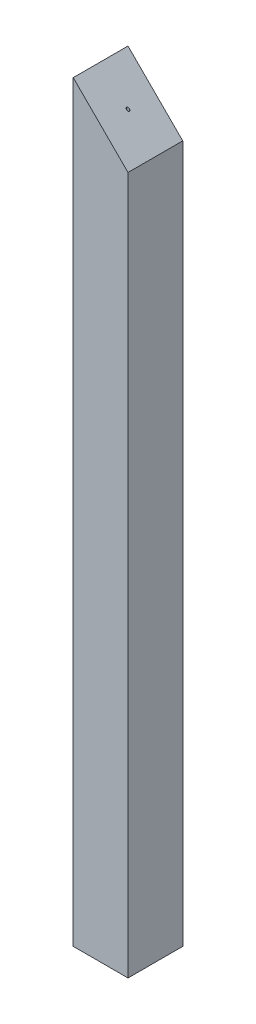
ISO-10303-21;
HEADER;
FILE_DESCRIPTION(('STEP AP214'),'2;1');
FILE_NAME('part.step','',(''),(''),'','','');
FILE_SCHEMA(('AUTOMOTIVE_DESIGN { 1 0 10303 214 1 1 1 1 }'));
ENDSEC;
DATA;
#1=APPLICATION_CONTEXT('core data for automotive mechanical design processes');
#2=APPLICATION_PROTOCOL_DEFINITION('international standard','automotive_design',2000,#1);
#3=PRODUCT_CONTEXT('',#1,'mechanical');
#4=PRODUCT('Part','Part','',(#3));
#5=PRODUCT_RELATED_PRODUCT_CATEGORY('part','',(#4));
#6=PRODUCT_DEFINITION_FORMATION('','',#4);
#7=PRODUCT_DEFINITION_CONTEXT('part definition',#1,'design');
#8=PRODUCT_DEFINITION('design','',#6,#7);
#9=PRODUCT_DEFINITION_SHAPE('','',#8);
#10=(LENGTH_UNIT() NAMED_UNIT(*) SI_UNIT(.MILLI.,.METRE.));
#11=(NAMED_UNIT(*) PLANE_ANGLE_UNIT() SI_UNIT($,.RADIAN.));
#12=(NAMED_UNIT(*) SI_UNIT($,.STERADIAN.) SOLID_ANGLE_UNIT());
#13=UNCERTAINTY_MEASURE_WITH_UNIT(LENGTH_MEASURE(1.E-05),#10,'distance_accuracy_value','');
#14=(GEOMETRIC_REPRESENTATION_CONTEXT(3) GLOBAL_UNCERTAINTY_ASSIGNED_CONTEXT((#13)) GLOBAL_UNIT_ASSIGNED_CONTEXT((#10,
#11,#12)) REPRESENTATION_CONTEXT('',''));
#15=CARTESIAN_POINT('',(0.,0.,0.));
#16=DIRECTION('',(0.,0.,1.));
#17=DIRECTION('',(1.,0.,0.));
#18=AXIS2_PLACEMENT_3D('',#15,#16,#17);
#19=CARTESIAN_POINT('',(12.7,174.485,-12.7));
#20=DIRECTION('',(-1.,0.,0.));
#21=DIRECTION('',(0.,0.,1.));
#22=AXIS2_PLACEMENT_3D('',#19,#20,#21);
#23=PLANE('',#22);
#24=DIRECTION('',(0.,-1.,0.));
#25=VECTOR('',#24,1.);
#26=CARTESIAN_POINT('',(12.7,174.485,-12.7));
#27=LINE('',#26,#25);
#28=CARTESIAN_POINT('',(12.7,149.085,-12.7));
#29=VERTEX_POINT('',#28);
#30=CARTESIAN_POINT('',(12.7,-174.485,-12.7));
#31=VERTEX_POINT('',#30);
#32=EDGE_CURVE('E11',#29,#31,#27,.T.);
#33=ORIENTED_EDGE('',*,*,#32,.F.);
#34=DIRECTION('',(0.,0.,1.));
#35=VECTOR('',#34,1.);
#36=CARTESIAN_POINT('',(12.7,149.085,-12.7));
#37=LINE('',#36,#35);
#38=CARTESIAN_POINT('',(12.7,149.085,12.7));
#39=VERTEX_POINT('',#38);
#40=EDGE_CURVE('E105',#29,#39,#37,.T.);
#41=ORIENTED_EDGE('',*,*,#40,.T.);
#42=DIRECTION('',(0.,-1.,0.));
#43=VECTOR('',#42,1.);
#44=CARTESIAN_POINT('',(12.7,174.485,12.7));
#45=LINE('',#44,#43);
#46=CARTESIAN_POINT('',(12.7,-174.485,12.7));
#47=VERTEX_POINT('',#46);
#48=EDGE_CURVE('E90',#39,#47,#45,.T.);
#49=ORIENTED_EDGE('',*,*,#48,.T.);
#50=DIRECTION('',(0.,0.,-1.));
#51=VECTOR('',#50,1.);
#52=CARTESIAN_POINT('',(12.7,-174.485,-12.7));
#53=LINE('',#52,#51);
#54=EDGE_CURVE('E94',#47,#31,#53,.T.);
#55=ORIENTED_EDGE('',*,*,#54,.T.);
#56=EDGE_LOOP('',(#33,#41,#49,#55));
#57=FACE_BOUND('',#56,.T.);
#58=ADVANCED_FACE('F37',(#57),#23,.F.);
#59=CARTESIAN_POINT('',(-12.7,174.485,-12.7));
#60=DIRECTION('',(0.,0.,1.));
#61=DIRECTION('',(1.,0.,0.));
#62=AXIS2_PLACEMENT_3D('',#59,#60,#61);
#63=PLANE('',#62);
#64=DIRECTION('',(0.,-1.,0.));
#65=VECTOR('',#64,1.);
#66=CARTESIAN_POINT('',(-12.7,174.485,-12.7));
#67=LINE('',#66,#65);
#68=CARTESIAN_POINT('',(-12.7,174.485,-12.7));
#69=VERTEX_POINT('',#68);
#70=CARTESIAN_POINT('',(-12.7,-174.485,-12.7));
#71=VERTEX_POINT('',#70);
#72=EDGE_CURVE('E46',#69,#71,#67,.T.);
#73=ORIENTED_EDGE('',*,*,#72,.F.);
#74=DIRECTION('',(0.707106781186549,-0.707106781186546,0.));
#75=VECTOR('',#74,1.);
#76=CARTESIAN_POINT('',(-12.7,174.485,-12.7));
#77=LINE('',#76,#75);
#78=EDGE_CURVE('E53',#69,#29,#77,.T.);
#79=ORIENTED_EDGE('',*,*,#78,.T.);
#80=ORIENTED_EDGE('',*,*,#32,.T.);
#81=DIRECTION('',(-1.,0.,0.));
#82=VECTOR('',#81,1.);
#83=CARTESIAN_POINT('',(-12.7,-174.485,-12.7));
#84=LINE('',#83,#82);
#85=EDGE_CURVE('E80',#31,#71,#84,.T.);
#86=ORIENTED_EDGE('',*,*,#85,.T.);
#87=EDGE_LOOP('',(#73,#79,#80,#86));
#88=FACE_BOUND('',#87,.T.);
#89=ADVANCED_FACE('F132',(#88),#63,.F.);
#90=CARTESIAN_POINT('',(-12.7,174.485,-12.7));
#91=DIRECTION('',(1.,0.,0.));
#92=DIRECTION('',(0.,0.,-1.));
#93=AXIS2_PLACEMENT_3D('',#90,#91,#92);
#94=PLANE('',#93);
#95=DIRECTION('',(0.,0.,1.));
#96=VECTOR('',#95,1.);
#97=CARTESIAN_POINT('',(-12.7,-174.485,-12.7));
#98=LINE('',#97,#96);
#99=CARTESIAN_POINT('',(-12.7,-174.485,12.7));
#100=VERTEX_POINT('',#99);
#101=EDGE_CURVE('E70',#71,#100,#98,.T.);
#102=ORIENTED_EDGE('',*,*,#101,.T.);
#103=DIRECTION('',(0.,-1.,0.));
#104=VECTOR('',#103,1.);
#105=CARTESIAN_POINT('',(-12.7,174.485,12.7));
#106=LINE('',#105,#104);
#107=CARTESIAN_POINT('',(-12.7,174.485,12.7));
#108=VERTEX_POINT('',#107);
#109=EDGE_CURVE('E75',#108,#100,#106,.T.);
#110=ORIENTED_EDGE('',*,*,#109,.F.);
#111=DIRECTION('',(0.,0.,1.));
#112=VECTOR('',#111,1.);
#113=CARTESIAN_POINT('',(-12.7,174.485,-12.7));
#114=LINE('',#113,#112);
#115=EDGE_CURVE('E95',#69,#108,#114,.T.);
#116=ORIENTED_EDGE('',*,*,#115,.F.);
#117=ORIENTED_EDGE('',*,*,#72,.T.);
#118=EDGE_LOOP('',(#102,#110,#116,#117));
#119=FACE_BOUND('',#118,.T.);
#120=ADVANCED_FACE('F72',(#119),#94,.F.);
#121=CARTESIAN_POINT('',(-12.7,174.485,12.7));
#122=DIRECTION('',(0.,0.,-1.));
#123=DIRECTION('',(-1.,0.,0.));
#124=AXIS2_PLACEMENT_3D('',#121,#122,#123);
#125=PLANE('',#124);
#126=ORIENTED_EDGE('',*,*,#48,.F.);
#127=DIRECTION('',(0.707106781186549,-0.707106781186546,0.));
#128=VECTOR('',#127,1.);
#129=CARTESIAN_POINT('',(-12.7,174.485,12.7));
#130=LINE('',#129,#128);
#131=EDGE_CURVE('E89',#108,#39,#130,.T.);
#132=ORIENTED_EDGE('',*,*,#131,.F.);
#133=ORIENTED_EDGE('',*,*,#109,.T.);
#134=DIRECTION('',(1.,0.,0.));
#135=VECTOR('',#134,1.);
#136=CARTESIAN_POINT('',(-12.7,-174.485,12.7));
#137=LINE('',#136,#135);
#138=EDGE_CURVE('E79',#100,#47,#137,.T.);
#139=ORIENTED_EDGE('',*,*,#138,.T.);
#140=EDGE_LOOP('',(#126,#132,#133,#139));
#141=FACE_BOUND('',#140,.T.);
#142=ADVANCED_FACE('F86',(#141),#125,.F.);
#143=CARTESIAN_POINT('',(0.,-174.485,0.));
#144=DIRECTION('',(0.,1.,0.));
#145=DIRECTION('',(0.,0.,1.));
#146=AXIS2_PLACEMENT_3D('',#143,#144,#145);
#147=PLANE('',#146);
#148=CARTESIAN_POINT('',(0.,-174.485,0.));
#149=DIRECTION('',(0.,-1.,0.));
#150=DIRECTION('',(0.,0.,-1.));
#151=AXIS2_PLACEMENT_3D('',#148,#149,#150);
#152=CIRCLE('',#151,1.5113);
#153=CARTESIAN_POINT('',(0.,-174.485,-1.5113));
#154=VERTEX_POINT('',#153);
#155=EDGE_CURVE('E128',#154,#154,#152,.T.);
#156=ORIENTED_EDGE('',*,*,#155,.F.);
#157=EDGE_LOOP('',(#156));
#158=FACE_BOUND('',#157,.T.);
#159=ORIENTED_EDGE('',*,*,#54,.F.);
#160=ORIENTED_EDGE('',*,*,#138,.F.);
#161=ORIENTED_EDGE('',*,*,#101,.F.);
#162=ORIENTED_EDGE('',*,*,#85,.F.);
#163=EDGE_LOOP('',(#159,#160,#161,#162));
#164=FACE_BOUND('',#163,.T.);
#165=ADVANCED_FACE('F92',(#158,#164),#147,.F.);
#166=CARTESIAN_POINT('',(0.,-154.485,0.));
#167=DIRECTION('',(0.,-1.,0.));
#168=DIRECTION('',(0.,0.,-1.));
#169=AXIS2_PLACEMENT_3D('',#166,#167,#168);
#170=CONICAL_SURFACE('',#169,0.595629999999985,1.02974425867667);
#171=CARTESIAN_POINT('',(0.,-154.127109389489,0.));
#172=VERTEX_POINT('',#171);
#173=VERTEX_LOOP('',#172);
#174=FACE_BOUND('',#173,.T.);
#175=CARTESIAN_POINT('',(0.,-154.485,0.));
#176=DIRECTION('',(0.,-1.,0.));
#177=DIRECTION('',(0.,0.,-1.));
#178=AXIS2_PLACEMENT_3D('',#175,#176,#177);
#179=CIRCLE('',#178,0.595629999999985);
#180=CARTESIAN_POINT('',(0.,-154.485,-0.595629999999985));
#181=VERTEX_POINT('',#180);
#182=EDGE_CURVE('E122',#181,#181,#179,.T.);
#183=ORIENTED_EDGE('',*,*,#182,.T.);
#184=EDGE_LOOP('',(#183));
#185=FACE_BOUND('',#184,.T.);
#186=ADVANCED_FACE('F115',(#174,#185),#170,.F.);
#187=CARTESIAN_POINT('',(0.,-174.485,0.));
#188=DIRECTION('',(0.,-1.,0.));
#189=DIRECTION('',(0.,0.,-1.));
#190=AXIS2_PLACEMENT_3D('',#187,#188,#189);
#191=CYLINDRICAL_SURFACE('',#190,0.595629999999987);
#192=ORIENTED_EDGE('',*,*,#182,.F.);
#193=EDGE_LOOP('',(#192));
#194=FACE_BOUND('',#193,.T.);
#195=CARTESIAN_POINT('',(0.,-173.71666164072,0.));
#196=DIRECTION('',(0.,-1.,0.));
#197=DIRECTION('',(0.,0.,-1.));
#198=AXIS2_PLACEMENT_3D('',#195,#196,#197);
#199=CIRCLE('',#198,0.595629999999989);
#200=CARTESIAN_POINT('',(0.,-173.71666164072,-0.595629999999989));
#201=VERTEX_POINT('',#200);
#202=EDGE_CURVE('E124',#201,#201,#199,.T.);
#203=ORIENTED_EDGE('',*,*,#202,.T.);
#204=EDGE_LOOP('',(#203));
#205=FACE_BOUND('',#204,.T.);
#206=ADVANCED_FACE('F118',(#194,#205),#191,.F.);
#207=CARTESIAN_POINT('',(0.,-174.485,0.));
#208=DIRECTION('',(0.,-1.,0.));
#209=DIRECTION('',(0.,0.,-1.));
#210=AXIS2_PLACEMENT_3D('',#207,#208,#209);
#211=CONICAL_SURFACE('',#210,1.5113,0.872664625997162);
#212=ORIENTED_EDGE('',*,*,#202,.F.);
#213=EDGE_LOOP('',(#212));
#214=FACE_BOUND('',#213,.T.);
#215=ORIENTED_EDGE('',*,*,#155,.T.);
#216=EDGE_LOOP('',(#215));
#217=FACE_BOUND('',#216,.T.);
#218=ADVANCED_FACE('F142',(#214,#217),#211,.F.);
#219=CARTESIAN_POINT('',(-12.7,174.485,-12.7));
#220=DIRECTION('',(-0.707106781186546,-0.707106781186548,0.));
#221=DIRECTION('',(0.707106781186549,-0.707106781186547,0.));
#222=AXIS2_PLACEMENT_3D('',#219,#220,#221);
#223=PLANE('',#222);
#224=ORIENTED_EDGE('',*,*,#40,.F.);
#225=ORIENTED_EDGE('',*,*,#78,.F.);
#226=ORIENTED_EDGE('',*,*,#115,.T.);
#227=ORIENTED_EDGE('',*,*,#131,.T.);
#228=EDGE_LOOP('',(#224,#225,#226,#227));
#229=FACE_BOUND('',#228,.T.);
#230=CARTESIAN_POINT('',(0.,161.785,0.));
#231=DIRECTION('',(-0.707106781186546,-0.707106781186548,0.));
#232=DIRECTION('',(-0.707106781186549,0.707106781186547,0.));
#233=AXIS2_PLACEMENT_3D('',#230,#231,#232);
#234=ELLIPSE('',#233,0.842348024156268,0.595629999999987);
#235=CARTESIAN_POINT('',(-0.595629999999987,162.38063,0.));
#236=VERTEX_POINT('',#235);
#237=EDGE_CURVE('E40',#236,#236,#234,.F.);
#238=ORIENTED_EDGE('',*,*,#237,.F.);
#239=EDGE_LOOP('',(#238));
#240=FACE_BOUND('',#239,.T.);
#241=ADVANCED_FACE('F170',(#229,#240),#223,.F.);
#242=CARTESIAN_POINT('',(0.,154.485,0.));
#243=DIRECTION('',(0.,1.,0.));
#244=DIRECTION('',(0.,0.,1.));
#245=AXIS2_PLACEMENT_3D('',#242,#243,#244);
#246=CONICAL_SURFACE('',#245,0.595629999999985,1.02974425867667);
#247=CARTESIAN_POINT('',(0.,154.127109389489,0.));
#248=VERTEX_POINT('',#247);
#249=VERTEX_LOOP('',#248);
#250=FACE_BOUND('',#249,.T.);
#251=CARTESIAN_POINT('',(0.,154.485,0.));
#252=DIRECTION('',(0.,1.,0.));
#253=DIRECTION('',(0.,0.,1.));
#254=AXIS2_PLACEMENT_3D('',#251,#252,#253);
#255=CIRCLE('',#254,0.595629999999985);
#256=CARTESIAN_POINT('',(0.,154.485,0.595629999999985));
#257=VERTEX_POINT('',#256);
#258=EDGE_CURVE('E137',#257,#257,#255,.T.);
#259=ORIENTED_EDGE('',*,*,#258,.T.);
#260=EDGE_LOOP('',(#259));
#261=FACE_BOUND('',#260,.T.);
#262=ADVANCED_FACE('F175',(#250,#261),#246,.F.);
#263=CARTESIAN_POINT('',(0.,174.485,0.));
#264=DIRECTION('',(0.,1.,0.));
#265=DIRECTION('',(0.,0.,1.));
#266=AXIS2_PLACEMENT_3D('',#263,#264,#265);
#267=CYLINDRICAL_SURFACE('',#266,0.595629999999987);
#268=ORIENTED_EDGE('',*,*,#237,.T.);
#269=EDGE_LOOP('',(#268));
#270=FACE_BOUND('',#269,.T.);
#271=ORIENTED_EDGE('',*,*,#258,.F.);
#272=EDGE_LOOP('',(#271));
#273=FACE_BOUND('',#272,.T.);
#274=ADVANCED_FACE('F183',(#270,#273),#267,.F.);
#275=CLOSED_SHELL('',(#58,#89,#120,#142,#165,#186,#206,#218,#241,#262,#274));
#276=MANIFOLD_SOLID_BREP('B2',#275);
#277=ADVANCED_BREP_SHAPE_REPRESENTATION('',(#18,#276),#14);
#278=SHAPE_DEFINITION_REPRESENTATION(#9,#277);
ENDSEC;
END-ISO-10303-21;
